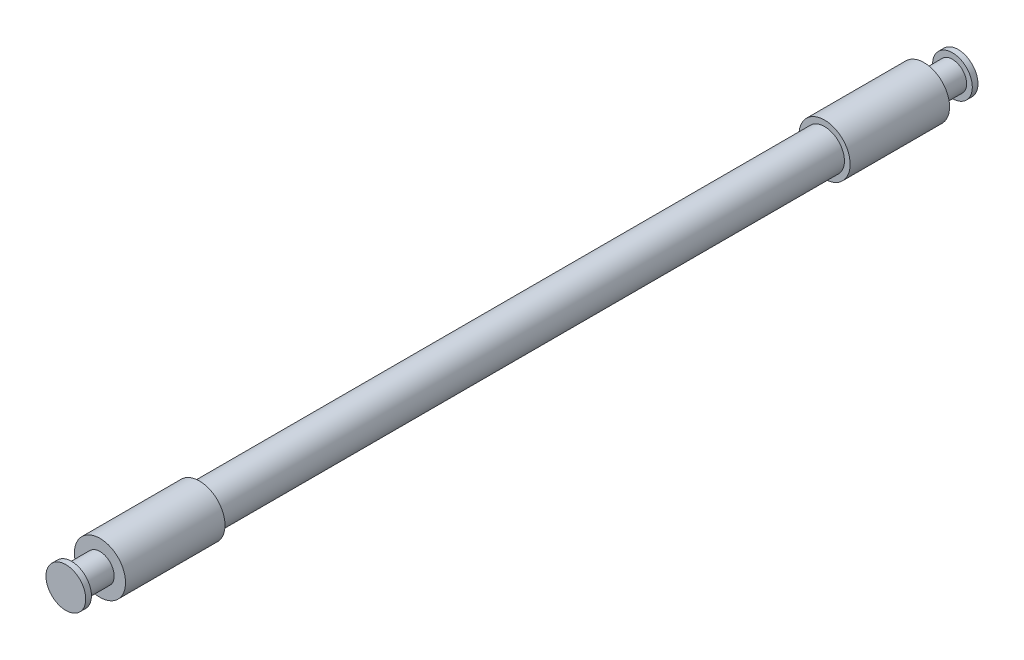
ISO-10303-21;
HEADER;
FILE_DESCRIPTION(('STEP AP214'),'2;1');
FILE_NAME('part.step','',(''),(''),'','','');
FILE_SCHEMA(('AUTOMOTIVE_DESIGN { 1 0 10303 214 1 1 1 1 }'));
ENDSEC;
DATA;
#1=APPLICATION_CONTEXT('core data for automotive mechanical design processes');
#2=APPLICATION_PROTOCOL_DEFINITION('international standard','automotive_design',2000,#1);
#3=PRODUCT_CONTEXT('',#1,'mechanical');
#4=PRODUCT('Part','Part','',(#3));
#5=PRODUCT_RELATED_PRODUCT_CATEGORY('part','',(#4));
#6=PRODUCT_DEFINITION_FORMATION('','',#4);
#7=PRODUCT_DEFINITION_CONTEXT('part definition',#1,'design');
#8=PRODUCT_DEFINITION('design','',#6,#7);
#9=PRODUCT_DEFINITION_SHAPE('','',#8);
#10=(LENGTH_UNIT() NAMED_UNIT(*) SI_UNIT(.MILLI.,.METRE.));
#11=(NAMED_UNIT(*) PLANE_ANGLE_UNIT() SI_UNIT($,.RADIAN.));
#12=(NAMED_UNIT(*) SI_UNIT($,.STERADIAN.) SOLID_ANGLE_UNIT());
#13=UNCERTAINTY_MEASURE_WITH_UNIT(LENGTH_MEASURE(1.E-05),#10,'distance_accuracy_value','');
#14=(GEOMETRIC_REPRESENTATION_CONTEXT(3) GLOBAL_UNCERTAINTY_ASSIGNED_CONTEXT((#13)) GLOBAL_UNIT_ASSIGNED_CONTEXT((#10,
#11,#12)) REPRESENTATION_CONTEXT('',''));
#15=CARTESIAN_POINT('',(0.,0.,0.));
#16=DIRECTION('',(0.,0.,1.));
#17=DIRECTION('',(1.,0.,0.));
#18=AXIS2_PLACEMENT_3D('',#15,#16,#17);
#19=CARTESIAN_POINT('',(0.,0.,199.39));
#20=DIRECTION('',(0.,0.,1.));
#21=DIRECTION('',(1.,0.,0.));
#22=AXIS2_PLACEMENT_3D('',#19,#20,#21);
#23=CYLINDRICAL_SURFACE('',#22,8.89000000000008);
#24=CARTESIAN_POINT('',(0.,0.,139.7));
#25=DIRECTION('',(0.,0.,1.));
#26=DIRECTION('',(1.,0.,0.));
#27=AXIS2_PLACEMENT_3D('',#24,#25,#26);
#28=CIRCLE('',#27,8.89000000000004);
#29=CARTESIAN_POINT('',(8.89000000000007,0.,139.7));
#30=VERTEX_POINT('',#29);
#31=EDGE_CURVE('E98',#30,#30,#28,.T.);
#32=ORIENTED_EDGE('',*,*,#31,.F.);
#33=EDGE_LOOP('',(#32));
#34=FACE_BOUND('',#33,.T.);
#35=CARTESIAN_POINT('',(0.,0.,-139.7));
#36=DIRECTION('',(0.,0.,1.));
#37=DIRECTION('',(1.,0.,0.));
#38=AXIS2_PLACEMENT_3D('',#35,#36,#37);
#39=CIRCLE('',#38,8.89000000000012);
#40=CARTESIAN_POINT('',(8.89000000000007,0.,-139.7));
#41=VERTEX_POINT('',#40);
#42=EDGE_CURVE('E10',#41,#41,#39,.T.);
#43=ORIENTED_EDGE('',*,*,#42,.T.);
#44=EDGE_LOOP('',(#43));
#45=FACE_BOUND('',#44,.T.);
#46=ADVANCED_FACE('F39',(#34,#45),#23,.T.);
#47=CARTESIAN_POINT('',(0.,0.,-139.7));
#48=DIRECTION('',(0.,0.,1.));
#49=DIRECTION('',(1.,0.,0.));
#50=AXIS2_PLACEMENT_3D('',#47,#48,#49);
#51=PLANE('',#50);
#52=CARTESIAN_POINT('',(0.,0.,-139.7));
#53=DIRECTION('',(0.,0.,1.));
#54=DIRECTION('',(1.,0.,0.));
#55=AXIS2_PLACEMENT_3D('',#52,#53,#54);
#56=CIRCLE('',#55,11.4300000000001);
#57=CARTESIAN_POINT('',(11.4300000000001,0.,-139.7));
#58=VERTEX_POINT('',#57);
#59=EDGE_CURVE('E46',#58,#58,#56,.T.);
#60=ORIENTED_EDGE('',*,*,#59,.T.);
#61=EDGE_LOOP('',(#60));
#62=FACE_BOUND('',#61,.T.);
#63=ORIENTED_EDGE('',*,*,#42,.F.);
#64=EDGE_LOOP('',(#63));
#65=FACE_BOUND('',#64,.T.);
#66=ADVANCED_FACE('F106',(#62,#65),#51,.T.);
#67=CARTESIAN_POINT('',(0.,0.,199.39));
#68=DIRECTION('',(0.,0.,1.));
#69=DIRECTION('',(1.,0.,0.));
#70=AXIS2_PLACEMENT_3D('',#67,#68,#69);
#71=CYLINDRICAL_SURFACE('',#70,11.4300000000001);
#72=CARTESIAN_POINT('',(0.,0.,-184.15));
#73=DIRECTION('',(0.,0.,1.));
#74=DIRECTION('',(1.,0.,0.));
#75=AXIS2_PLACEMENT_3D('',#72,#73,#74);
#76=CIRCLE('',#75,11.4300000000001);
#77=CARTESIAN_POINT('',(11.4300000000001,0.,-184.15));
#78=VERTEX_POINT('',#77);
#79=EDGE_CURVE('E51',#78,#78,#76,.T.);
#80=ORIENTED_EDGE('',*,*,#79,.T.);
#81=EDGE_LOOP('',(#80));
#82=FACE_BOUND('',#81,.T.);
#83=ORIENTED_EDGE('',*,*,#59,.F.);
#84=EDGE_LOOP('',(#83));
#85=FACE_BOUND('',#84,.T.);
#86=ADVANCED_FACE('F110',(#82,#85),#71,.T.);
#87=CARTESIAN_POINT('',(0.,0.,-184.15));
#88=DIRECTION('',(0.,0.,-1.));
#89=DIRECTION('',(-1.,0.,0.));
#90=AXIS2_PLACEMENT_3D('',#87,#88,#89);
#91=PLANE('',#90);
#92=CARTESIAN_POINT('',(0.,0.,-184.15));
#93=DIRECTION('',(0.,0.,1.));
#94=DIRECTION('',(1.,0.,0.));
#95=AXIS2_PLACEMENT_3D('',#92,#93,#94);
#96=CIRCLE('',#95,6.35000000000012);
#97=CARTESIAN_POINT('',(6.35000000000005,0.,-184.15));
#98=VERTEX_POINT('',#97);
#99=EDGE_CURVE('E56',#98,#98,#96,.T.);
#100=ORIENTED_EDGE('',*,*,#99,.T.);
#101=EDGE_LOOP('',(#100));
#102=FACE_BOUND('',#101,.T.);
#103=ORIENTED_EDGE('',*,*,#79,.F.);
#104=EDGE_LOOP('',(#103));
#105=FACE_BOUND('',#104,.T.);
#106=ADVANCED_FACE('F114',(#102,#105),#91,.T.);
#107=CARTESIAN_POINT('',(0.,0.,199.39));
#108=DIRECTION('',(0.,0.,1.));
#109=DIRECTION('',(1.,0.,0.));
#110=AXIS2_PLACEMENT_3D('',#107,#108,#109);
#111=CYLINDRICAL_SURFACE('',#110,6.35000000000012);
#112=ORIENTED_EDGE('',*,*,#99,.F.);
#113=EDGE_LOOP('',(#112));
#114=FACE_BOUND('',#113,.T.);
#115=CARTESIAN_POINT('',(0.,0.,-196.85));
#116=DIRECTION('',(0.,0.,1.));
#117=DIRECTION('',(1.,0.,0.));
#118=AXIS2_PLACEMENT_3D('',#115,#116,#117);
#119=CIRCLE('',#118,6.35000000000012);
#120=CARTESIAN_POINT('',(6.35000000000005,0.,-196.85));
#121=VERTEX_POINT('',#120);
#122=EDGE_CURVE('E62',#121,#121,#119,.T.);
#123=ORIENTED_EDGE('',*,*,#122,.T.);
#124=EDGE_LOOP('',(#123));
#125=FACE_BOUND('',#124,.T.);
#126=ADVANCED_FACE('F121',(#114,#125),#111,.T.);
#127=CARTESIAN_POINT('',(0.,0.,-196.85));
#128=DIRECTION('',(0.,0.,-1.));
#129=DIRECTION('',(-1.,0.,0.));
#130=AXIS2_PLACEMENT_3D('',#127,#128,#129);
#131=PLANE('',#130);
#132=ORIENTED_EDGE('',*,*,#122,.F.);
#133=EDGE_LOOP('',(#132));
#134=FACE_BOUND('',#133,.T.);
#135=CARTESIAN_POINT('',(0.,0.,-196.85));
#136=DIRECTION('',(0.,0.,1.));
#137=DIRECTION('',(1.,0.,0.));
#138=AXIS2_PLACEMENT_3D('',#135,#136,#137);
#139=CIRCLE('',#138,8.89000000000012);
#140=CARTESIAN_POINT('',(8.89000000000005,0.,-196.85));
#141=VERTEX_POINT('',#140);
#142=EDGE_CURVE('E66',#141,#141,#139,.T.);
#143=ORIENTED_EDGE('',*,*,#142,.T.);
#144=EDGE_LOOP('',(#143));
#145=FACE_BOUND('',#144,.T.);
#146=ADVANCED_FACE('F125',(#134,#145),#131,.F.);
#147=CARTESIAN_POINT('',(0.,0.,199.39));
#148=DIRECTION('',(0.,0.,1.));
#149=DIRECTION('',(1.,0.,0.));
#150=AXIS2_PLACEMENT_3D('',#147,#148,#149);
#151=CYLINDRICAL_SURFACE('',#150,8.89000000000012);
#152=ORIENTED_EDGE('',*,*,#142,.F.);
#153=EDGE_LOOP('',(#152));
#154=FACE_BOUND('',#153,.T.);
#155=CARTESIAN_POINT('',(0.,0.,-199.39));
#156=DIRECTION('',(0.,0.,1.));
#157=DIRECTION('',(1.,0.,0.));
#158=AXIS2_PLACEMENT_3D('',#155,#156,#157);
#159=CIRCLE('',#158,8.89000000000012);
#160=CARTESIAN_POINT('',(8.89000000000005,0.,-199.39));
#161=VERTEX_POINT('',#160);
#162=EDGE_CURVE('E70',#161,#161,#159,.T.);
#163=ORIENTED_EDGE('',*,*,#162,.T.);
#164=EDGE_LOOP('',(#163));
#165=FACE_BOUND('',#164,.T.);
#166=ADVANCED_FACE('F129',(#154,#165),#151,.T.);
#167=CARTESIAN_POINT('',(0.,0.,-199.39));
#168=DIRECTION('',(0.,0.,1.));
#169=DIRECTION('',(1.,0.,0.));
#170=AXIS2_PLACEMENT_3D('',#167,#168,#169);
#171=PLANE('',#170);
#172=ORIENTED_EDGE('',*,*,#162,.F.);
#173=EDGE_LOOP('',(#172));
#174=FACE_BOUND('',#173,.T.);
#175=ADVANCED_FACE('F133',(#174),#171,.F.);
#176=CARTESIAN_POINT('',(0.,0.,199.39));
#177=DIRECTION('',(0.,0.,1.));
#178=DIRECTION('',(1.,0.,0.));
#179=AXIS2_PLACEMENT_3D('',#176,#177,#178);
#180=PLANE('',#179);
#181=CARTESIAN_POINT('',(0.,0.,199.39));
#182=DIRECTION('',(0.,0.,1.));
#183=DIRECTION('',(1.,0.,0.));
#184=AXIS2_PLACEMENT_3D('',#181,#182,#183);
#185=CIRCLE('',#184,8.89);
#186=CARTESIAN_POINT('',(8.89000000000005,0.,199.39));
#187=VERTEX_POINT('',#186);
#188=EDGE_CURVE('E74',#187,#187,#185,.T.);
#189=ORIENTED_EDGE('',*,*,#188,.T.);
#190=EDGE_LOOP('',(#189));
#191=FACE_BOUND('',#190,.T.);
#192=ADVANCED_FACE('F137',(#191),#180,.T.);
#193=CARTESIAN_POINT('',(0.,0.,199.39));
#194=DIRECTION('',(0.,0.,1.));
#195=DIRECTION('',(1.,0.,0.));
#196=AXIS2_PLACEMENT_3D('',#193,#194,#195);
#197=CYLINDRICAL_SURFACE('',#196,8.89);
#198=CARTESIAN_POINT('',(0.,0.,196.85));
#199=DIRECTION('',(0.,0.,1.));
#200=DIRECTION('',(1.,0.,0.));
#201=AXIS2_PLACEMENT_3D('',#198,#199,#200);
#202=CIRCLE('',#201,8.89);
#203=CARTESIAN_POINT('',(8.89000000000004,0.,196.85));
#204=VERTEX_POINT('',#203);
#205=EDGE_CURVE('E78',#204,#204,#202,.T.);
#206=ORIENTED_EDGE('',*,*,#205,.T.);
#207=EDGE_LOOP('',(#206));
#208=FACE_BOUND('',#207,.T.);
#209=ORIENTED_EDGE('',*,*,#188,.F.);
#210=EDGE_LOOP('',(#209));
#211=FACE_BOUND('',#210,.T.);
#212=ADVANCED_FACE('F141',(#208,#211),#197,.T.);
#213=CARTESIAN_POINT('',(0.,0.,196.85));
#214=DIRECTION('',(0.,0.,-1.));
#215=DIRECTION('',(-1.,0.,0.));
#216=AXIS2_PLACEMENT_3D('',#213,#214,#215);
#217=PLANE('',#216);
#218=CARTESIAN_POINT('',(0.,0.,196.85));
#219=DIRECTION('',(0.,0.,1.));
#220=DIRECTION('',(1.,0.,0.));
#221=AXIS2_PLACEMENT_3D('',#218,#219,#220);
#222=CIRCLE('',#221,6.35);
#223=CARTESIAN_POINT('',(6.35000000000005,0.,196.85));
#224=VERTEX_POINT('',#223);
#225=EDGE_CURVE('E82',#224,#224,#222,.T.);
#226=ORIENTED_EDGE('',*,*,#225,.T.);
#227=EDGE_LOOP('',(#226));
#228=FACE_BOUND('',#227,.T.);
#229=ORIENTED_EDGE('',*,*,#205,.F.);
#230=EDGE_LOOP('',(#229));
#231=FACE_BOUND('',#230,.T.);
#232=ADVANCED_FACE('F145',(#228,#231),#217,.T.);
#233=CARTESIAN_POINT('',(0.,0.,199.39));
#234=DIRECTION('',(0.,0.,1.));
#235=DIRECTION('',(1.,0.,0.));
#236=AXIS2_PLACEMENT_3D('',#233,#234,#235);
#237=CYLINDRICAL_SURFACE('',#236,6.35);
#238=CARTESIAN_POINT('',(0.,0.,184.15));
#239=DIRECTION('',(0.,0.,1.));
#240=DIRECTION('',(1.,0.,0.));
#241=AXIS2_PLACEMENT_3D('',#238,#239,#240);
#242=CIRCLE('',#241,6.35);
#243=CARTESIAN_POINT('',(6.35000000000005,0.,184.15));
#244=VERTEX_POINT('',#243);
#245=EDGE_CURVE('E86',#244,#244,#242,.T.);
#246=ORIENTED_EDGE('',*,*,#245,.T.);
#247=EDGE_LOOP('',(#246));
#248=FACE_BOUND('',#247,.T.);
#249=ORIENTED_EDGE('',*,*,#225,.F.);
#250=EDGE_LOOP('',(#249));
#251=FACE_BOUND('',#250,.T.);
#252=ADVANCED_FACE('F149',(#248,#251),#237,.T.);
#253=CARTESIAN_POINT('',(0.,0.,184.15));
#254=DIRECTION('',(0.,0.,-1.));
#255=DIRECTION('',(-1.,0.,0.));
#256=AXIS2_PLACEMENT_3D('',#253,#254,#255);
#257=PLANE('',#256);
#258=ORIENTED_EDGE('',*,*,#245,.F.);
#259=EDGE_LOOP('',(#258));
#260=FACE_BOUND('',#259,.T.);
#261=CARTESIAN_POINT('',(0.,0.,184.15));
#262=DIRECTION('',(0.,0.,1.));
#263=DIRECTION('',(1.,0.,0.));
#264=AXIS2_PLACEMENT_3D('',#261,#262,#263);
#265=CIRCLE('',#264,11.43);
#266=CARTESIAN_POINT('',(11.4300000000001,0.,184.15));
#267=VERTEX_POINT('',#266);
#268=EDGE_CURVE('E90',#267,#267,#265,.T.);
#269=ORIENTED_EDGE('',*,*,#268,.T.);
#270=EDGE_LOOP('',(#269));
#271=FACE_BOUND('',#270,.T.);
#272=ADVANCED_FACE('F153',(#260,#271),#257,.F.);
#273=CARTESIAN_POINT('',(0.,0.,199.39));
#274=DIRECTION('',(0.,0.,1.));
#275=DIRECTION('',(1.,0.,0.));
#276=AXIS2_PLACEMENT_3D('',#273,#274,#275);
#277=CYLINDRICAL_SURFACE('',#276,11.43);
#278=ORIENTED_EDGE('',*,*,#268,.F.);
#279=EDGE_LOOP('',(#278));
#280=FACE_BOUND('',#279,.T.);
#281=CARTESIAN_POINT('',(0.,0.,139.7));
#282=DIRECTION('',(0.,0.,1.));
#283=DIRECTION('',(1.,0.,0.));
#284=AXIS2_PLACEMENT_3D('',#281,#282,#283);
#285=CIRCLE('',#284,11.43);
#286=CARTESIAN_POINT('',(11.4300000000001,0.,139.7));
#287=VERTEX_POINT('',#286);
#288=EDGE_CURVE('E94',#287,#287,#285,.T.);
#289=ORIENTED_EDGE('',*,*,#288,.T.);
#290=EDGE_LOOP('',(#289));
#291=FACE_BOUND('',#290,.T.);
#292=ADVANCED_FACE('F157',(#280,#291),#277,.T.);
#293=CARTESIAN_POINT('',(0.,0.,139.7));
#294=DIRECTION('',(0.,0.,1.));
#295=DIRECTION('',(1.,0.,0.));
#296=AXIS2_PLACEMENT_3D('',#293,#294,#295);
#297=PLANE('',#296);
#298=ORIENTED_EDGE('',*,*,#288,.F.);
#299=EDGE_LOOP('',(#298));
#300=FACE_BOUND('',#299,.T.);
#301=ORIENTED_EDGE('',*,*,#31,.T.);
#302=EDGE_LOOP('',(#301));
#303=FACE_BOUND('',#302,.T.);
#304=ADVANCED_FACE('F103',(#300,#303),#297,.F.);
#305=CLOSED_SHELL('',(#46,#66,#86,#106,#126,#146,#166,#175,#192,#212,#232,#252,#272,#292,#304));
#306=MANIFOLD_SOLID_BREP('B2',#305);
#307=ADVANCED_BREP_SHAPE_REPRESENTATION('',(#18,#306),#14);
#308=SHAPE_DEFINITION_REPRESENTATION(#9,#307);
ENDSEC;
END-ISO-10303-21;
